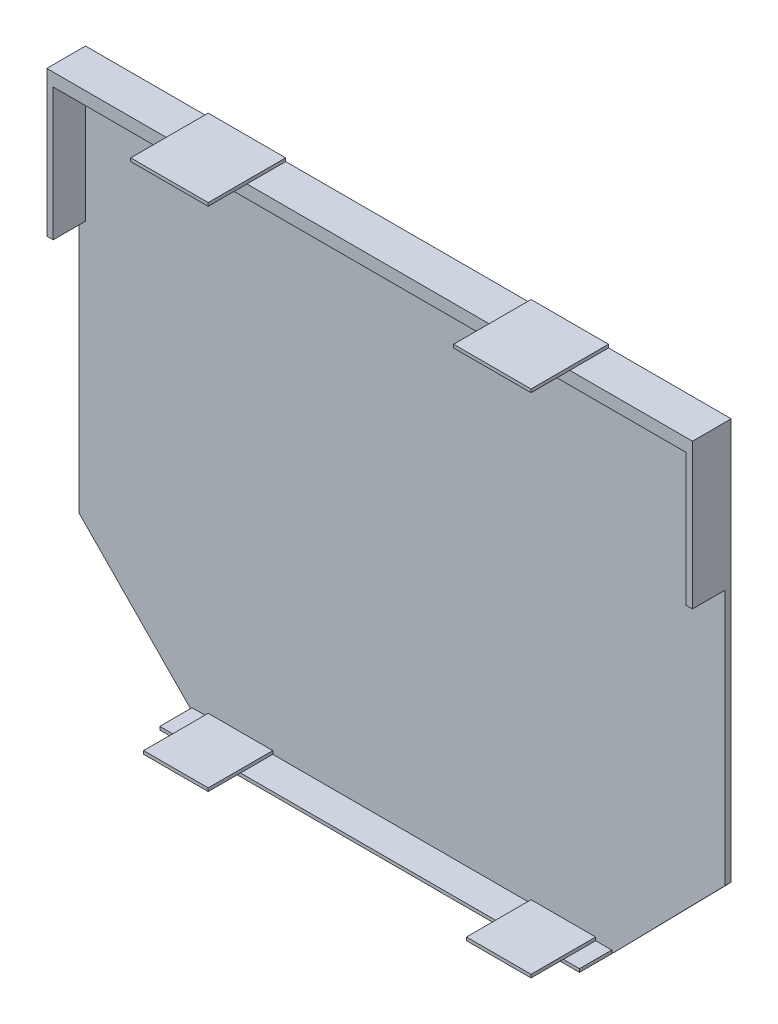
ISO-10303-21;
HEADER;
FILE_DESCRIPTION(('STEP AP214'),'2;1');
FILE_NAME('part.step','',(''),(''),'','','');
FILE_SCHEMA(('AUTOMOTIVE_DESIGN { 1 0 10303 214 1 1 1 1 }'));
ENDSEC;
DATA;
#1=APPLICATION_CONTEXT('core data for automotive mechanical design processes');
#2=APPLICATION_PROTOCOL_DEFINITION('international standard','automotive_design',2000,#1);
#3=PRODUCT_CONTEXT('',#1,'mechanical');
#4=PRODUCT('Part','Part','',(#3));
#5=PRODUCT_RELATED_PRODUCT_CATEGORY('part','',(#4));
#6=PRODUCT_DEFINITION_FORMATION('','',#4);
#7=PRODUCT_DEFINITION_CONTEXT('part definition',#1,'design');
#8=PRODUCT_DEFINITION('design','',#6,#7);
#9=PRODUCT_DEFINITION_SHAPE('','',#8);
#10=(LENGTH_UNIT() NAMED_UNIT(*) SI_UNIT(.MILLI.,.METRE.));
#11=(NAMED_UNIT(*) PLANE_ANGLE_UNIT() SI_UNIT($,.RADIAN.));
#12=(NAMED_UNIT(*) SI_UNIT($,.STERADIAN.) SOLID_ANGLE_UNIT());
#13=UNCERTAINTY_MEASURE_WITH_UNIT(LENGTH_MEASURE(1.E-05),#10,'distance_accuracy_value','');
#14=(GEOMETRIC_REPRESENTATION_CONTEXT(3) GLOBAL_UNCERTAINTY_ASSIGNED_CONTEXT((#13)) GLOBAL_UNIT_ASSIGNED_CONTEXT((#10,
#11,#12)) REPRESENTATION_CONTEXT('',''));
#15=CARTESIAN_POINT('',(0.,0.,0.));
#16=DIRECTION('',(0.,0.,1.));
#17=DIRECTION('',(1.,0.,0.));
#18=AXIS2_PLACEMENT_3D('',#15,#16,#17);
#19=CARTESIAN_POINT('',(0.,0.,-59.));
#20=DIRECTION('',(0.,0.,-1.));
#21=DIRECTION('',(-1.,0.,0.));
#22=AXIS2_PLACEMENT_3D('',#19,#20,#21);
#23=PLANE('',#22);
#24=DIRECTION('',(0.,-1.,0.));
#25=VECTOR('',#24,1.);
#26=CARTESIAN_POINT('',(140.,2.00000000000003,-59.));
#27=LINE('',#26,#25);
#28=CARTESIAN_POINT('',(140.,2.00000000000003,-59.));
#29=VERTEX_POINT('',#28);
#30=CARTESIAN_POINT('',(140.,1.,-59.));
#31=VERTEX_POINT('',#30);
#32=EDGE_CURVE('E55',#29,#31,#27,.T.);
#33=ORIENTED_EDGE('',*,*,#32,.F.);
#34=DIRECTION('',(-1.,0.,0.));
#35=VECTOR('',#34,1.);
#36=CARTESIAN_POINT('',(160.,2.00000000000003,-59.));
#37=LINE('',#36,#35);
#38=CARTESIAN_POINT('',(160.,2.00000000000003,-59.));
#39=VERTEX_POINT('',#38);
#40=EDGE_CURVE('E50',#39,#29,#37,.T.);
#41=ORIENTED_EDGE('',*,*,#40,.F.);
#42=DIRECTION('',(0.,-1.,0.));
#43=VECTOR('',#42,1.);
#44=CARTESIAN_POINT('',(160.,2.00000000000003,-59.));
#45=LINE('',#44,#43);
#46=CARTESIAN_POINT('',(160.,1.,-59.));
#47=VERTEX_POINT('',#46);
#48=EDGE_CURVE('E287',#39,#47,#45,.T.);
#49=ORIENTED_EDGE('',*,*,#48,.T.);
#50=DIRECTION('',(1.,0.,0.));
#51=VECTOR('',#50,1.);
#52=CARTESIAN_POINT('',(35.,1.,-59.));
#53=LINE('',#52,#51);
#54=CARTESIAN_POINT('',(165.,1.,-59.));
#55=VERTEX_POINT('',#54);
#56=EDGE_CURVE('E420',#47,#55,#53,.T.);
#57=ORIENTED_EDGE('',*,*,#56,.T.);
#58=DIRECTION('',(0.,1.,0.));
#59=VECTOR('',#58,1.);
#60=CARTESIAN_POINT('',(165.,0.,-59.));
#61=LINE('',#60,#59);
#62=CARTESIAN_POINT('',(165.,0.,-59.));
#63=VERTEX_POINT('',#62);
#64=EDGE_CURVE('E424',#63,#55,#61,.T.);
#65=ORIENTED_EDGE('',*,*,#64,.F.);
#66=DIRECTION('',(0.7,0.714142842854285,0.));
#67=VECTOR('',#66,1.);
#68=CARTESIAN_POINT('',(84.15,-82.4834983496699,-59.));
#69=LINE('',#68,#67);
#70=CARTESIAN_POINT('',(200.,35.7071421427142,-59.));
#71=VERTEX_POINT('',#70);
#72=EDGE_CURVE('E451',#63,#71,#69,.T.);
#73=ORIENTED_EDGE('',*,*,#72,.T.);
#74=DIRECTION('',(0.,-1.,0.));
#75=VECTOR('',#74,1.);
#76=CARTESIAN_POINT('',(200.,0.,-59.));
#77=LINE('',#76,#75);
#78=CARTESIAN_POINT('',(200.,115.,-59.));
#79=VERTEX_POINT('',#78);
#80=EDGE_CURVE('E455',#79,#71,#77,.T.);
#81=ORIENTED_EDGE('',*,*,#80,.F.);
#82=DIRECTION('',(1.,0.,0.));
#83=VECTOR('',#82,1.);
#84=CARTESIAN_POINT('',(1.5959455978987E-12,115.000000000003,-59.));
#85=LINE('',#84,#83);
#86=CARTESIAN_POINT('',(198.,115.,-59.));
#87=VERTEX_POINT('',#86);
#88=EDGE_CURVE('E413',#87,#79,#85,.T.);
#89=ORIENTED_EDGE('',*,*,#88,.F.);
#90=DIRECTION('',(0.,-1.,0.));
#91=VECTOR('',#90,1.);
#92=CARTESIAN_POINT('',(198.,0.,-59.));
#93=LINE('',#92,#91);
#94=CARTESIAN_POINT('',(198.,156.,-59.));
#95=VERTEX_POINT('',#94);
#96=EDGE_CURVE('E410',#95,#87,#93,.T.);
#97=ORIENTED_EDGE('',*,*,#96,.F.);
#98=DIRECTION('',(1.,0.,0.));
#99=VECTOR('',#98,1.);
#100=CARTESIAN_POINT('',(0.,156.,-59.));
#101=LINE('',#100,#99);
#102=CARTESIAN_POINT('',(2.,156.,-59.));
#103=VERTEX_POINT('',#102);
#104=EDGE_CURVE('E407',#103,#95,#101,.T.);
#105=ORIENTED_EDGE('',*,*,#104,.F.);
#106=DIRECTION('',(0.,-1.,0.));
#107=VECTOR('',#106,1.);
#108=CARTESIAN_POINT('',(2.00000000000002,0.,-59.));
#109=LINE('',#108,#107);
#110=CARTESIAN_POINT('',(2.,115.,-59.));
#111=VERTEX_POINT('',#110);
#112=EDGE_CURVE('E392',#103,#111,#109,.T.);
#113=ORIENTED_EDGE('',*,*,#112,.T.);
#114=DIRECTION('',(-1.,0.,0.));
#115=VECTOR('',#114,1.);
#116=CARTESIAN_POINT('',(0.,115.,-59.));
#117=LINE('',#116,#115);
#118=CARTESIAN_POINT('',(0.,115.,-59.));
#119=VERTEX_POINT('',#118);
#120=EDGE_CURVE('E396',#111,#119,#117,.T.);
#121=ORIENTED_EDGE('',*,*,#120,.T.);
#122=DIRECTION('',(0.,-1.,0.));
#123=VECTOR('',#122,1.);
#124=CARTESIAN_POINT('',(0.,0.,-59.));
#125=LINE('',#124,#123);
#126=CARTESIAN_POINT('',(0.,35.7071421427142,-59.));
#127=VERTEX_POINT('',#126);
#128=EDGE_CURVE('E457',#119,#127,#125,.T.);
#129=ORIENTED_EDGE('',*,*,#128,.T.);
#130=DIRECTION('',(-0.7,0.714142842854285,0.));
#131=VECTOR('',#130,1.);
#132=CARTESIAN_POINT('',(17.85,17.49649964993,-59.));
#133=LINE('',#132,#131);
#134=CARTESIAN_POINT('',(35.,0.,-59.));
#135=VERTEX_POINT('',#134);
#136=EDGE_CURVE('E448',#135,#127,#133,.T.);
#137=ORIENTED_EDGE('',*,*,#136,.F.);
#138=DIRECTION('',(0.,1.,0.));
#139=VECTOR('',#138,1.);
#140=CARTESIAN_POINT('',(35.,0.,-59.));
#141=LINE('',#140,#139);
#142=CARTESIAN_POINT('',(35.,1.,-59.));
#143=VERTEX_POINT('',#142);
#144=EDGE_CURVE('E404',#135,#143,#141,.T.);
#145=ORIENTED_EDGE('',*,*,#144,.T.);
#146=CARTESIAN_POINT('',(40.,1.00000000000001,-59.));
#147=VERTEX_POINT('',#146);
#148=EDGE_CURVE('E421',#143,#147,#53,.T.);
#149=ORIENTED_EDGE('',*,*,#148,.T.);
#150=DIRECTION('',(0.,-1.,0.));
#151=VECTOR('',#150,1.);
#152=CARTESIAN_POINT('',(40.,2.00000000000001,-59.));
#153=LINE('',#152,#151);
#154=CARTESIAN_POINT('',(40.,2.00000000000001,-59.));
#155=VERTEX_POINT('',#154);
#156=EDGE_CURVE('E300',#155,#147,#153,.T.);
#157=ORIENTED_EDGE('',*,*,#156,.F.);
#158=DIRECTION('',(-1.,0.,0.));
#159=VECTOR('',#158,1.);
#160=CARTESIAN_POINT('',(60.,2.00000000000001,-59.));
#161=LINE('',#160,#159);
#162=CARTESIAN_POINT('',(60.,2.00000000000001,-59.));
#163=VERTEX_POINT('',#162);
#164=EDGE_CURVE('E299',#163,#155,#161,.T.);
#165=ORIENTED_EDGE('',*,*,#164,.F.);
#166=DIRECTION('',(0.,-1.,0.));
#167=VECTOR('',#166,1.);
#168=CARTESIAN_POINT('',(60.,2.00000000000001,-59.));
#169=LINE('',#168,#167);
#170=CARTESIAN_POINT('',(60.,1.00000000000001,-59.));
#171=VERTEX_POINT('',#170);
#172=EDGE_CURVE('E307',#163,#171,#169,.T.);
#173=ORIENTED_EDGE('',*,*,#172,.T.);
#174=EDGE_CURVE('E425',#171,#31,#53,.T.);
#175=ORIENTED_EDGE('',*,*,#174,.T.);
#176=EDGE_LOOP('',(#33,#41,#49,#57,#65,#73,#81,#89,#97,#105,#113,#121,#129,#137,#145,#149,#157,
#165,#173,#175));
#177=FACE_BOUND('',#176,.T.);
#178=ADVANCED_FACE('F35',(#177),#23,.F.);
#179=CARTESIAN_POINT('',(1.00000000000002,1.,-49.));
#180=DIRECTION('',(0.,1.,0.));
#181=DIRECTION('',(-1.,0.,0.));
#182=AXIS2_PLACEMENT_3D('',#179,#180,#181);
#183=PLANE('',#182);
#184=DIRECTION('',(1.,0.,0.));
#185=VECTOR('',#184,1.);
#186=CARTESIAN_POINT('',(1.00000000000002,1.,-49.));
#187=LINE('',#186,#185);
#188=CARTESIAN_POINT('',(60.0000000000001,1.00000000000001,-49.));
#189=VERTEX_POINT('',#188);
#190=CARTESIAN_POINT('',(140.,1.00000000000003,-49.));
#191=VERTEX_POINT('',#190);
#192=EDGE_CURVE('E558',#189,#191,#187,.T.);
#193=ORIENTED_EDGE('',*,*,#192,.T.);
#194=DIRECTION('',(0.,0.,1.));
#195=VECTOR('',#194,1.);
#196=CARTESIAN_POINT('',(140.,1.00000000000003,-39.));
#197=LINE('',#196,#195);
#198=EDGE_CURVE('E542',#31,#191,#197,.T.);
#199=ORIENTED_EDGE('',*,*,#198,.F.);
#200=ORIENTED_EDGE('',*,*,#174,.F.);
#201=DIRECTION('',(0.,0.,1.));
#202=VECTOR('',#201,1.);
#203=CARTESIAN_POINT('',(60.0000000000001,1.00000000000001,-49.));
#204=LINE('',#203,#202);
#205=EDGE_CURVE('E11',#171,#189,#204,.T.);
#206=ORIENTED_EDGE('',*,*,#205,.T.);
#207=EDGE_LOOP('',(#193,#199,#200,#206));
#208=FACE_BOUND('',#207,.T.);
#209=ADVANCED_FACE('F565',(#208),#183,.T.);
#210=ORIENTED_EDGE('',*,*,#56,.F.);
#211=DIRECTION('',(0.,0.,-1.));
#212=VECTOR('',#211,1.);
#213=CARTESIAN_POINT('',(160.,1.00000000000003,-39.));
#214=LINE('',#213,#212);
#215=CARTESIAN_POINT('',(160.,1.00000000000003,-49.));
#216=VERTEX_POINT('',#215);
#217=EDGE_CURVE('E520',#216,#47,#214,.T.);
#218=ORIENTED_EDGE('',*,*,#217,.F.);
#219=CARTESIAN_POINT('',(165.,1.,-49.));
#220=VERTEX_POINT('',#219);
#221=EDGE_CURVE('E480',#216,#220,#187,.T.);
#222=ORIENTED_EDGE('',*,*,#221,.T.);
#223=DIRECTION('',(0.,0.,1.));
#224=VECTOR('',#223,1.);
#225=CARTESIAN_POINT('',(165.,1.,4.));
#226=LINE('',#225,#224);
#227=EDGE_CURVE('E383',#55,#220,#226,.T.);
#228=ORIENTED_EDGE('',*,*,#227,.F.);
#229=EDGE_LOOP('',(#210,#218,#222,#228));
#230=FACE_BOUND('',#229,.T.);
#231=ADVANCED_FACE('F517',(#230),#183,.T.);
#232=CARTESIAN_POINT('',(35.,1.,-49.));
#233=VERTEX_POINT('',#232);
#234=CARTESIAN_POINT('',(40.,1.00000000000001,-49.));
#235=VERTEX_POINT('',#234);
#236=EDGE_CURVE('E475',#233,#235,#187,.T.);
#237=ORIENTED_EDGE('',*,*,#236,.T.);
#238=DIRECTION('',(0.,0.,1.));
#239=VECTOR('',#238,1.);
#240=CARTESIAN_POINT('',(40.,1.00000000000001,-39.));
#241=LINE('',#240,#239);
#242=EDGE_CURVE('E285',#147,#235,#241,.T.);
#243=ORIENTED_EDGE('',*,*,#242,.F.);
#244=ORIENTED_EDGE('',*,*,#148,.F.);
#245=DIRECTION('',(0.,0.,-1.));
#246=VECTOR('',#245,1.);
#247=CARTESIAN_POINT('',(35.,1.,4.));
#248=LINE('',#247,#246);
#249=EDGE_CURVE('E508',#233,#143,#248,.T.);
#250=ORIENTED_EDGE('',*,*,#249,.F.);
#251=EDGE_LOOP('',(#237,#243,#244,#250));
#252=FACE_BOUND('',#251,.T.);
#253=ADVANCED_FACE('F580',(#252),#183,.T.);
#254=CARTESIAN_POINT('',(0.,160.,4.));
#255=DIRECTION('',(0.,1.,0.));
#256=DIRECTION('',(0.,0.,1.));
#257=AXIS2_PLACEMENT_3D('',#254,#255,#256);
#258=PLANE('',#257);
#259=DIRECTION('',(1.,0.,0.));
#260=VECTOR('',#259,1.);
#261=CARTESIAN_POINT('',(0.,160.,-61.));
#262=LINE('',#261,#260);
#263=CARTESIAN_POINT('',(62.,160.,-61.));
#264=VERTEX_POINT('',#263);
#265=CARTESIAN_POINT('',(138.,160.,-61.));
#266=VERTEX_POINT('',#265);
#267=EDGE_CURVE('E472',#264,#266,#262,.T.);
#268=ORIENTED_EDGE('',*,*,#267,.F.);
#269=DIRECTION('',(0.,0.,-1.));
#270=VECTOR('',#269,1.);
#271=CARTESIAN_POINT('',(62.,160.,-61.));
#272=LINE('',#271,#270);
#273=CARTESIAN_POINT('',(62.,160.,-49.));
#274=VERTEX_POINT('',#273);
#275=EDGE_CURVE('E316',#274,#264,#272,.T.);
#276=ORIENTED_EDGE('',*,*,#275,.F.);
#277=DIRECTION('',(-1.,0.,0.));
#278=VECTOR('',#277,1.);
#279=CARTESIAN_POINT('',(84.,160.,-49.));
#280=LINE('',#279,#278);
#281=CARTESIAN_POINT('',(138.,160.,-49.));
#282=VERTEX_POINT('',#281);
#283=EDGE_CURVE('E1186',#282,#274,#280,.T.);
#284=ORIENTED_EDGE('',*,*,#283,.F.);
#285=DIRECTION('',(0.,0.,1.));
#286=VECTOR('',#285,1.);
#287=CARTESIAN_POINT('',(138.,160.,-61.0000000000001));
#288=LINE('',#287,#286);
#289=EDGE_CURVE('E360',#266,#282,#288,.T.);
#290=ORIENTED_EDGE('',*,*,#289,.F.);
#291=EDGE_LOOP('',(#268,#276,#284,#290));
#292=FACE_BOUND('',#291,.T.);
#293=ADVANCED_FACE('F620',(#292),#258,.T.);
#294=CARTESIAN_POINT('',(38.,160.,-49.));
#295=VERTEX_POINT('',#294);
#296=CARTESIAN_POINT('',(0.,160.,-49.));
#297=VERTEX_POINT('',#296);
#298=EDGE_CURVE('E430',#295,#297,#280,.T.);
#299=ORIENTED_EDGE('',*,*,#298,.F.);
#300=DIRECTION('',(0.,0.,1.));
#301=VECTOR('',#300,1.);
#302=CARTESIAN_POINT('',(38.,160.,-61.));
#303=LINE('',#302,#301);
#304=CARTESIAN_POINT('',(38.,160.,-61.));
#305=VERTEX_POINT('',#304);
#306=EDGE_CURVE('E332',#305,#295,#303,.T.);
#307=ORIENTED_EDGE('',*,*,#306,.F.);
#308=CARTESIAN_POINT('',(0.,160.,-61.));
#309=VERTEX_POINT('',#308);
#310=EDGE_CURVE('E469',#309,#305,#262,.T.);
#311=ORIENTED_EDGE('',*,*,#310,.F.);
#312=DIRECTION('',(0.,0.,1.));
#313=VECTOR('',#312,1.);
#314=CARTESIAN_POINT('',(0.,160.,-59.));
#315=LINE('',#314,#313);
#316=EDGE_CURVE('E379',#309,#297,#315,.T.);
#317=ORIENTED_EDGE('',*,*,#316,.T.);
#318=EDGE_LOOP('',(#299,#307,#311,#317));
#319=FACE_BOUND('',#318,.T.);
#320=ADVANCED_FACE('F614',(#319),#258,.T.);
#321=CARTESIAN_POINT('',(0.,-0.0100000000000378,-49.));
#322=DIRECTION('',(0.,0.,1.));
#323=DIRECTION('',(1.,0.,0.));
#324=AXIS2_PLACEMENT_3D('',#321,#322,#323);
#325=PLANE('',#324);
#326=DIRECTION('',(0.,-1.,0.));
#327=VECTOR('',#326,1.);
#328=CARTESIAN_POINT('',(35.,0.,-49.));
#329=LINE('',#328,#327);
#330=CARTESIAN_POINT('',(35.,0.,-49.));
#331=VERTEX_POINT('',#330);
#332=EDGE_CURVE('E487',#233,#331,#329,.T.);
#333=ORIENTED_EDGE('',*,*,#332,.T.);
#334=DIRECTION('',(1.,0.,0.));
#335=VECTOR('',#334,1.);
#336=CARTESIAN_POINT('',(0.,0.,-49.));
#337=LINE('',#336,#335);
#338=CARTESIAN_POINT('',(165.,0.,-49.));
#339=VERTEX_POINT('',#338);
#340=EDGE_CURVE('E378',#331,#339,#337,.T.);
#341=ORIENTED_EDGE('',*,*,#340,.T.);
#342=DIRECTION('',(0.,-1.,0.));
#343=VECTOR('',#342,1.);
#344=CARTESIAN_POINT('',(165.,0.,-49.));
#345=LINE('',#344,#343);
#346=EDGE_CURVE('E484',#220,#339,#345,.T.);
#347=ORIENTED_EDGE('',*,*,#346,.F.);
#348=ORIENTED_EDGE('',*,*,#221,.F.);
#349=EDGE_CURVE('E523',#191,#216,#187,.T.);
#350=ORIENTED_EDGE('',*,*,#349,.F.);
#351=ORIENTED_EDGE('',*,*,#192,.F.);
#352=EDGE_CURVE('E479',#235,#189,#187,.T.);
#353=ORIENTED_EDGE('',*,*,#352,.F.);
#354=ORIENTED_EDGE('',*,*,#236,.F.);
#355=EDGE_LOOP('',(#333,#341,#347,#348,#350,#351,#353,#354));
#356=FACE_BOUND('',#355,.T.);
#357=ADVANCED_FACE('F524',(#356),#325,.T.);
#358=DIRECTION('',(0.,-1.,0.));
#359=VECTOR('',#358,1.);
#360=CARTESIAN_POINT('',(198.,0.,-49.));
#361=LINE('',#360,#359);
#362=CARTESIAN_POINT('',(198.,156.,-49.));
#363=VERTEX_POINT('',#362);
#364=CARTESIAN_POINT('',(198.,115.,-49.));
#365=VERTEX_POINT('',#364);
#366=EDGE_CURVE('E395',#363,#365,#361,.T.);
#367=ORIENTED_EDGE('',*,*,#366,.T.);
#368=DIRECTION('',(-1.,0.,0.));
#369=VECTOR('',#368,1.);
#370=CARTESIAN_POINT('',(0.,115.,-49.));
#371=LINE('',#370,#369);
#372=CARTESIAN_POINT('',(200.,115.,-49.));
#373=VERTEX_POINT('',#372);
#374=EDGE_CURVE('E481',#373,#365,#371,.T.);
#375=ORIENTED_EDGE('',*,*,#374,.F.);
#376=DIRECTION('',(0.,1.,0.));
#377=VECTOR('',#376,1.);
#378=CARTESIAN_POINT('',(200.,0.,-49.));
#379=LINE('',#378,#377);
#380=CARTESIAN_POINT('',(200.,160.,-49.));
#381=VERTEX_POINT('',#380);
#382=EDGE_CURVE('E398',#373,#381,#379,.T.);
#383=ORIENTED_EDGE('',*,*,#382,.T.);
#384=CARTESIAN_POINT('',(162.,160.,-49.));
#385=VERTEX_POINT('',#384);
#386=EDGE_CURVE('E431',#381,#385,#280,.T.);
#387=ORIENTED_EDGE('',*,*,#386,.T.);
#388=EDGE_CURVE('E435',#385,#282,#280,.T.);
#389=ORIENTED_EDGE('',*,*,#388,.T.);
#390=ORIENTED_EDGE('',*,*,#283,.T.);
#391=DIRECTION('',(-1.,0.,0.));
#392=VECTOR('',#391,1.);
#393=CARTESIAN_POINT('',(0.,160.,-49.));
#394=LINE('',#393,#392);
#395=EDGE_CURVE('E345',#274,#295,#394,.T.);
#396=ORIENTED_EDGE('',*,*,#395,.T.);
#397=ORIENTED_EDGE('',*,*,#298,.T.);
#398=DIRECTION('',(0.,1.,0.));
#399=VECTOR('',#398,1.);
#400=CARTESIAN_POINT('',(0.,0.,-49.));
#401=LINE('',#400,#399);
#402=CARTESIAN_POINT('',(0.,115.,-49.));
#403=VERTEX_POINT('',#402);
#404=EDGE_CURVE('E401',#403,#297,#401,.T.);
#405=ORIENTED_EDGE('',*,*,#404,.F.);
#406=DIRECTION('',(1.,0.,0.));
#407=VECTOR('',#406,1.);
#408=CARTESIAN_POINT('',(0.,115.,-49.));
#409=LINE('',#408,#407);
#410=CARTESIAN_POINT('',(2.,115.,-49.));
#411=VERTEX_POINT('',#410);
#412=EDGE_CURVE('E490',#403,#411,#409,.T.);
#413=ORIENTED_EDGE('',*,*,#412,.T.);
#414=DIRECTION('',(0.,-1.,0.));
#415=VECTOR('',#414,1.);
#416=CARTESIAN_POINT('',(2.00000000000002,0.,-49.));
#417=LINE('',#416,#415);
#418=CARTESIAN_POINT('',(2.,156.,-49.));
#419=VERTEX_POINT('',#418);
#420=EDGE_CURVE('E393',#419,#411,#417,.T.);
#421=ORIENTED_EDGE('',*,*,#420,.F.);
#422=DIRECTION('',(1.,0.,0.));
#423=VECTOR('',#422,1.);
#424=CARTESIAN_POINT('',(2.,156.,-49.));
#425=LINE('',#424,#423);
#426=EDGE_CURVE('E428',#419,#363,#425,.T.);
#427=ORIENTED_EDGE('',*,*,#426,.T.);
#428=EDGE_LOOP('',(#367,#375,#383,#387,#389,#390,#396,#397,#405,#413,#421,#427));
#429=FACE_BOUND('',#428,.T.);
#430=ADVANCED_FACE('F613',(#429),#325,.T.);
#431=CARTESIAN_POINT('',(84.15,-82.4834983496699,-61.));
#432=DIRECTION('',(0.714142842854285,-0.7,0.));
#433=DIRECTION('',(0.7,0.714142842854285,0.));
#434=AXIS2_PLACEMENT_3D('',#431,#432,#433);
#435=PLANE('',#434);
#436=ORIENTED_EDGE('',*,*,#72,.F.);
#437=DIRECTION('',(0.,0.,1.));
#438=VECTOR('',#437,1.);
#439=CARTESIAN_POINT('',(165.,0.,-61.));
#440=LINE('',#439,#438);
#441=CARTESIAN_POINT('',(165.,0.,-61.));
#442=VERTEX_POINT('',#441);
#443=EDGE_CURVE('E438',#442,#63,#440,.T.);
#444=ORIENTED_EDGE('',*,*,#443,.F.);
#445=DIRECTION('',(0.7,0.714142842854285,0.));
#446=VECTOR('',#445,1.);
#447=CARTESIAN_POINT('',(84.15,-82.4834983496699,-61.));
#448=LINE('',#447,#446);
#449=CARTESIAN_POINT('',(200.,35.7071421427142,-61.));
#450=VERTEX_POINT('',#449);
#451=EDGE_CURVE('E463',#442,#450,#448,.T.);
#452=ORIENTED_EDGE('',*,*,#451,.T.);
#453=DIRECTION('',(0.,0.,1.));
#454=VECTOR('',#453,1.);
#455=CARTESIAN_POINT('',(200.,35.7071421427142,-61.));
#456=LINE('',#455,#454);
#457=EDGE_CURVE('E434',#450,#71,#456,.T.);
#458=ORIENTED_EDGE('',*,*,#457,.T.);
#459=EDGE_LOOP('',(#436,#444,#452,#458));
#460=FACE_BOUND('',#459,.T.);
#461=ADVANCED_FACE('F533',(#460),#435,.T.);
#462=CARTESIAN_POINT('',(0.,115.,4.));
#463=DIRECTION('',(0.,-1.,0.));
#464=DIRECTION('',(0.,0.,-1.));
#465=AXIS2_PLACEMENT_3D('',#462,#463,#464);
#466=PLANE('',#465);
#467=DIRECTION('',(0.,0.,-1.));
#468=VECTOR('',#467,1.);
#469=CARTESIAN_POINT('',(200.,115.,4.));
#470=LINE('',#469,#468);
#471=EDGE_CURVE('E478',#373,#79,#470,.T.);
#472=ORIENTED_EDGE('',*,*,#471,.F.);
#473=ORIENTED_EDGE('',*,*,#374,.T.);
#474=DIRECTION('',(0.,0.,1.));
#475=VECTOR('',#474,1.);
#476=CARTESIAN_POINT('',(198.,115.,-49.));
#477=LINE('',#476,#475);
#478=EDGE_CURVE('E498',#87,#365,#477,.T.);
#479=ORIENTED_EDGE('',*,*,#478,.F.);
#480=ORIENTED_EDGE('',*,*,#88,.T.);
#481=EDGE_LOOP('',(#472,#473,#479,#480));
#482=FACE_BOUND('',#481,.T.);
#483=ADVANCED_FACE('F37',(#482),#466,.T.);
#484=CARTESIAN_POINT('',(198.,156.,-49.));
#485=DIRECTION('',(-1.,0.,0.));
#486=DIRECTION('',(0.,0.,1.));
#487=AXIS2_PLACEMENT_3D('',#484,#485,#486);
#488=PLANE('',#487);
#489=ORIENTED_EDGE('',*,*,#478,.T.);
#490=ORIENTED_EDGE('',*,*,#366,.F.);
#491=DIRECTION('',(0.,0.,1.));
#492=VECTOR('',#491,1.);
#493=CARTESIAN_POINT('',(198.,156.,-59.));
#494=LINE('',#493,#492);
#495=EDGE_CURVE('E386',#95,#363,#494,.T.);
#496=ORIENTED_EDGE('',*,*,#495,.F.);
#497=ORIENTED_EDGE('',*,*,#96,.T.);
#498=EDGE_LOOP('',(#489,#490,#496,#497));
#499=FACE_BOUND('',#498,.T.);
#500=ADVANCED_FACE('F636',(#499),#488,.T.);
#501=CARTESIAN_POINT('',(2.,156.,-49.));
#502=DIRECTION('',(1.,0.,0.));
#503=DIRECTION('',(0.,1.,0.));
#504=AXIS2_PLACEMENT_3D('',#501,#502,#503);
#505=PLANE('',#504);
#506=ORIENTED_EDGE('',*,*,#420,.T.);
#507=DIRECTION('',(0.,0.,1.));
#508=VECTOR('',#507,1.);
#509=CARTESIAN_POINT('',(2.,115.,-49.));
#510=LINE('',#509,#508);
#511=EDGE_CURVE('E501',#111,#411,#510,.T.);
#512=ORIENTED_EDGE('',*,*,#511,.F.);
#513=ORIENTED_EDGE('',*,*,#112,.F.);
#514=DIRECTION('',(0.,0.,1.));
#515=VECTOR('',#514,1.);
#516=CARTESIAN_POINT('',(2.,156.,-59.));
#517=LINE('',#516,#515);
#518=EDGE_CURVE('E389',#103,#419,#517,.T.);
#519=ORIENTED_EDGE('',*,*,#518,.T.);
#520=EDGE_LOOP('',(#506,#512,#513,#519));
#521=FACE_BOUND('',#520,.T.);
#522=ADVANCED_FACE('F837',(#521),#505,.T.);
#523=CARTESIAN_POINT('',(2.,156.,-49.));
#524=DIRECTION('',(0.,-1.,0.));
#525=DIRECTION('',(0.,0.,-1.));
#526=AXIS2_PLACEMENT_3D('',#523,#524,#525);
#527=PLANE('',#526);
#528=ORIENTED_EDGE('',*,*,#495,.T.);
#529=ORIENTED_EDGE('',*,*,#426,.F.);
#530=ORIENTED_EDGE('',*,*,#518,.F.);
#531=ORIENTED_EDGE('',*,*,#104,.T.);
#532=EDGE_LOOP('',(#528,#529,#530,#531));
#533=FACE_BOUND('',#532,.T.);
#534=ADVANCED_FACE('F855',(#533),#527,.T.);
#535=CARTESIAN_POINT('',(17.85,17.49649964993,-61.));
#536=DIRECTION('',(0.714142842854285,0.7,0.));
#537=DIRECTION('',(-0.7,0.714142842854285,0.));
#538=AXIS2_PLACEMENT_3D('',#535,#536,#537);
#539=PLANE('',#538);
#540=ORIENTED_EDGE('',*,*,#136,.T.);
#541=DIRECTION('',(0.,0.,1.));
#542=VECTOR('',#541,1.);
#543=CARTESIAN_POINT('',(0.,35.7071421427142,-61.));
#544=LINE('',#543,#542);
#545=CARTESIAN_POINT('',(0.,35.7071421427142,-61.));
#546=VERTEX_POINT('',#545);
#547=EDGE_CURVE('E444',#546,#127,#544,.T.);
#548=ORIENTED_EDGE('',*,*,#547,.F.);
#549=DIRECTION('',(-0.7,0.714142842854285,0.));
#550=VECTOR('',#549,1.);
#551=CARTESIAN_POINT('',(17.85,17.49649964993,-61.));
#552=LINE('',#551,#550);
#553=CARTESIAN_POINT('',(35.,0.,-61.));
#554=VERTEX_POINT('',#553);
#555=EDGE_CURVE('E447',#554,#546,#552,.T.);
#556=ORIENTED_EDGE('',*,*,#555,.F.);
#557=DIRECTION('',(0.,0.,1.));
#558=VECTOR('',#557,1.);
#559=CARTESIAN_POINT('',(35.,0.,-61.));
#560=LINE('',#559,#558);
#561=EDGE_CURVE('E441',#554,#135,#560,.T.);
#562=ORIENTED_EDGE('',*,*,#561,.T.);
#563=EDGE_LOOP('',(#540,#548,#556,#562));
#564=FACE_BOUND('',#563,.T.);
#565=ADVANCED_FACE('F604',(#564),#539,.F.);
#566=CARTESIAN_POINT('',(0.,115.,4.));
#567=DIRECTION('',(0.,1.,0.));
#568=DIRECTION('',(0.,0.,1.));
#569=AXIS2_PLACEMENT_3D('',#566,#567,#568);
#570=PLANE('',#569);
#571=ORIENTED_EDGE('',*,*,#412,.F.);
#572=DIRECTION('',(0.,0.,-1.));
#573=VECTOR('',#572,1.);
#574=CARTESIAN_POINT('',(0.,115.,4.));
#575=LINE('',#574,#573);
#576=EDGE_CURVE('E496',#403,#119,#575,.T.);
#577=ORIENTED_EDGE('',*,*,#576,.T.);
#578=ORIENTED_EDGE('',*,*,#120,.F.);
#579=ORIENTED_EDGE('',*,*,#511,.T.);
#580=EDGE_LOOP('',(#571,#577,#578,#579));
#581=FACE_BOUND('',#580,.T.);
#582=ADVANCED_FACE('F888',(#581),#570,.F.);
#583=CARTESIAN_POINT('',(0.,0.,4.));
#584=DIRECTION('',(-1.,0.,0.));
#585=DIRECTION('',(0.,0.,1.));
#586=AXIS2_PLACEMENT_3D('',#583,#584,#585);
#587=PLANE('',#586);
#588=ORIENTED_EDGE('',*,*,#576,.F.);
#589=ORIENTED_EDGE('',*,*,#404,.T.);
#590=ORIENTED_EDGE('',*,*,#316,.F.);
#591=DIRECTION('',(0.,-1.,0.));
#592=VECTOR('',#591,1.);
#593=CARTESIAN_POINT('',(0.,0.,-61.));
#594=LINE('',#593,#592);
#595=EDGE_CURVE('E452',#309,#546,#594,.T.);
#596=ORIENTED_EDGE('',*,*,#595,.T.);
#597=ORIENTED_EDGE('',*,*,#547,.T.);
#598=ORIENTED_EDGE('',*,*,#128,.F.);
#599=EDGE_LOOP('',(#588,#589,#590,#596,#597,#598));
#600=FACE_BOUND('',#599,.T.);
#601=ADVANCED_FACE('F610',(#600),#587,.T.);
#602=CARTESIAN_POINT('',(0.,0.,-61.));
#603=DIRECTION('',(0.,0.,-1.));
#604=DIRECTION('',(-1.,0.,0.));
#605=AXIS2_PLACEMENT_3D('',#602,#603,#604);
#606=PLANE('',#605);
#607=ORIENTED_EDGE('',*,*,#595,.F.);
#608=ORIENTED_EDGE('',*,*,#310,.T.);
#609=DIRECTION('',(0.,-1.,0.));
#610=VECTOR('',#609,1.);
#611=CARTESIAN_POINT('',(38.,161.,-61.));
#612=LINE('',#611,#610);
#613=CARTESIAN_POINT('',(38.,161.,-61.));
#614=VERTEX_POINT('',#613);
#615=EDGE_CURVE('E341',#614,#305,#612,.T.);
#616=ORIENTED_EDGE('',*,*,#615,.F.);
#617=DIRECTION('',(-1.,0.,0.));
#618=VECTOR('',#617,1.);
#619=CARTESIAN_POINT('',(38.,161.,-61.));
#620=LINE('',#619,#618);
#621=CARTESIAN_POINT('',(62.,161.,-61.));
#622=VERTEX_POINT('',#621);
#623=EDGE_CURVE('E320',#622,#614,#620,.T.);
#624=ORIENTED_EDGE('',*,*,#623,.F.);
#625=DIRECTION('',(0.,-1.,0.));
#626=VECTOR('',#625,1.);
#627=CARTESIAN_POINT('',(62.,161.,-61.));
#628=LINE('',#627,#626);
#629=EDGE_CURVE('E343',#622,#264,#628,.T.);
#630=ORIENTED_EDGE('',*,*,#629,.T.);
#631=ORIENTED_EDGE('',*,*,#267,.T.);
#632=DIRECTION('',(0.,-1.,0.));
#633=VECTOR('',#632,1.);
#634=CARTESIAN_POINT('',(138.,161.,-61.0000000000001));
#635=LINE('',#634,#633);
#636=CARTESIAN_POINT('',(138.,161.,-61.0000000000001));
#637=VERTEX_POINT('',#636);
#638=EDGE_CURVE('E359',#637,#266,#635,.T.);
#639=ORIENTED_EDGE('',*,*,#638,.F.);
#640=DIRECTION('',(-1.,0.,0.));
#641=VECTOR('',#640,1.);
#642=CARTESIAN_POINT('',(162.,161.,-61.));
#643=LINE('',#642,#641);
#644=CARTESIAN_POINT('',(162.,161.,-61.));
#645=VERTEX_POINT('',#644);
#646=EDGE_CURVE('E357',#645,#637,#643,.T.);
#647=ORIENTED_EDGE('',*,*,#646,.F.);
#648=DIRECTION('',(0.,-1.,0.));
#649=VECTOR('',#648,1.);
#650=CARTESIAN_POINT('',(162.,161.,-61.));
#651=LINE('',#650,#649);
#652=CARTESIAN_POINT('',(162.,160.,-61.));
#653=VERTEX_POINT('',#652);
#654=EDGE_CURVE('E369',#645,#653,#651,.T.);
#655=ORIENTED_EDGE('',*,*,#654,.T.);
#656=CARTESIAN_POINT('',(200.,160.,-61.));
#657=VERTEX_POINT('',#656);
#658=EDGE_CURVE('E468',#653,#657,#262,.T.);
#659=ORIENTED_EDGE('',*,*,#658,.T.);
#660=DIRECTION('',(0.,-1.,0.));
#661=VECTOR('',#660,1.);
#662=CARTESIAN_POINT('',(200.,0.,-61.));
#663=LINE('',#662,#661);
#664=EDGE_CURVE('E466',#657,#450,#663,.T.);
#665=ORIENTED_EDGE('',*,*,#664,.T.);
#666=ORIENTED_EDGE('',*,*,#451,.F.);
#667=DIRECTION('',(1.,0.,0.));
#668=VECTOR('',#667,1.);
#669=CARTESIAN_POINT('',(0.,0.,-61.));
#670=LINE('',#669,#668);
#671=EDGE_CURVE('E460',#554,#442,#670,.T.);
#672=ORIENTED_EDGE('',*,*,#671,.F.);
#673=ORIENTED_EDGE('',*,*,#555,.T.);
#674=EDGE_LOOP('',(#607,#608,#616,#624,#630,#631,#639,#647,#655,#659,#665,#666,#672,#673));
#675=FACE_BOUND('',#674,.T.);
#676=ADVANCED_FACE('F606',(#675),#606,.T.);
#677=CARTESIAN_POINT('',(200.,0.,4.));
#678=DIRECTION('',(-1.,0.,0.));
#679=DIRECTION('',(0.,0.,1.));
#680=AXIS2_PLACEMENT_3D('',#677,#678,#679);
#681=PLANE('',#680);
#682=ORIENTED_EDGE('',*,*,#382,.F.);
#683=ORIENTED_EDGE('',*,*,#471,.T.);
#684=ORIENTED_EDGE('',*,*,#80,.T.);
#685=ORIENTED_EDGE('',*,*,#457,.F.);
#686=ORIENTED_EDGE('',*,*,#664,.F.);
#687=DIRECTION('',(0.,0.,1.));
#688=VECTOR('',#687,1.);
#689=CARTESIAN_POINT('',(200.,160.,-59.));
#690=LINE('',#689,#688);
#691=EDGE_CURVE('E382',#657,#381,#690,.T.);
#692=ORIENTED_EDGE('',*,*,#691,.T.);
#693=EDGE_LOOP('',(#682,#683,#684,#685,#686,#692));
#694=FACE_BOUND('',#693,.T.);
#695=ADVANCED_FACE('F609',(#694),#681,.F.);
#696=DIRECTION('',(0.,0.,-1.));
#697=VECTOR('',#696,1.);
#698=CARTESIAN_POINT('',(162.,160.,-61.));
#699=LINE('',#698,#697);
#700=EDGE_CURVE('E43',#385,#653,#699,.T.);
#701=ORIENTED_EDGE('',*,*,#700,.F.);
#702=ORIENTED_EDGE('',*,*,#386,.F.);
#703=ORIENTED_EDGE('',*,*,#691,.F.);
#704=ORIENTED_EDGE('',*,*,#658,.F.);
#705=EDGE_LOOP('',(#701,#702,#703,#704));
#706=FACE_BOUND('',#705,.T.);
#707=ADVANCED_FACE('F594',(#706),#258,.T.);
#708=CARTESIAN_POINT('',(165.,0.,4.));
#709=DIRECTION('',(1.,0.,0.));
#710=DIRECTION('',(0.,0.,-1.));
#711=AXIS2_PLACEMENT_3D('',#708,#709,#710);
#712=PLANE('',#711);
#713=ORIENTED_EDGE('',*,*,#227,.T.);
#714=ORIENTED_EDGE('',*,*,#346,.T.);
#715=DIRECTION('',(0.,0.,1.));
#716=VECTOR('',#715,1.);
#717=CARTESIAN_POINT('',(165.,0.,4.));
#718=LINE('',#717,#716);
#719=EDGE_CURVE('E506',#63,#339,#718,.T.);
#720=ORIENTED_EDGE('',*,*,#719,.F.);
#721=ORIENTED_EDGE('',*,*,#64,.T.);
#722=EDGE_LOOP('',(#713,#714,#720,#721));
#723=FACE_BOUND('',#722,.T.);
#724=ADVANCED_FACE('F512',(#723),#712,.T.);
#725=CARTESIAN_POINT('',(35.,0.,4.));
#726=DIRECTION('',(1.,0.,0.));
#727=DIRECTION('',(0.,1.,0.));
#728=AXIS2_PLACEMENT_3D('',#725,#726,#727);
#729=PLANE('',#728);
#730=ORIENTED_EDGE('',*,*,#332,.F.);
#731=ORIENTED_EDGE('',*,*,#249,.T.);
#732=ORIENTED_EDGE('',*,*,#144,.F.);
#733=DIRECTION('',(0.,0.,-1.));
#734=VECTOR('',#733,1.);
#735=CARTESIAN_POINT('',(35.,0.,4.));
#736=LINE('',#735,#734);
#737=EDGE_CURVE('E504',#331,#135,#736,.T.);
#738=ORIENTED_EDGE('',*,*,#737,.F.);
#739=EDGE_LOOP('',(#730,#731,#732,#738));
#740=FACE_BOUND('',#739,.T.);
#741=ADVANCED_FACE('F585',(#740),#729,.F.);
#742=CARTESIAN_POINT('',(0.,0.,4.));
#743=DIRECTION('',(0.,1.,0.));
#744=DIRECTION('',(0.,0.,1.));
#745=AXIS2_PLACEMENT_3D('',#742,#743,#744);
#746=PLANE('',#745);
#747=ORIENTED_EDGE('',*,*,#340,.F.);
#748=ORIENTED_EDGE('',*,*,#737,.T.);
#749=ORIENTED_EDGE('',*,*,#561,.F.);
#750=ORIENTED_EDGE('',*,*,#671,.T.);
#751=ORIENTED_EDGE('',*,*,#443,.T.);
#752=ORIENTED_EDGE('',*,*,#719,.T.);
#753=EDGE_LOOP('',(#747,#748,#749,#750,#751,#752));
#754=FACE_BOUND('',#753,.T.);
#755=ADVANCED_FACE('F528',(#754),#746,.F.);
#756=CARTESIAN_POINT('',(0.,160.,0.));
#757=DIRECTION('',(0.,-1.,0.));
#758=DIRECTION('',(0.,0.,-1.));
#759=AXIS2_PLACEMENT_3D('',#756,#757,#758);
#760=PLANE('',#759);
#761=ORIENTED_EDGE('',*,*,#388,.F.);
#762=CARTESIAN_POINT('',(162.,160.,-36.9999999999999));
#763=VERTEX_POINT('',#762);
#764=EDGE_CURVE('E353',#763,#385,#699,.T.);
#765=ORIENTED_EDGE('',*,*,#764,.F.);
#766=DIRECTION('',(1.,0.,0.));
#767=VECTOR('',#766,1.);
#768=CARTESIAN_POINT('',(162.,160.,-36.9999999999999));
#769=LINE('',#768,#767);
#770=CARTESIAN_POINT('',(138.,160.,-36.9999999999999));
#771=VERTEX_POINT('',#770);
#772=EDGE_CURVE('E363',#771,#763,#769,.T.);
#773=ORIENTED_EDGE('',*,*,#772,.F.);
#774=EDGE_CURVE('E348',#282,#771,#288,.T.);
#775=ORIENTED_EDGE('',*,*,#774,.F.);
#776=EDGE_LOOP('',(#761,#765,#773,#775));
#777=FACE_BOUND('',#776,.T.);
#778=ADVANCED_FACE('F592',(#777),#760,.T.);
#779=CARTESIAN_POINT('',(138.,161.,-61.0000000000001));
#780=DIRECTION('',(1.,0.,0.));
#781=DIRECTION('',(0.,0.,-1.));
#782=AXIS2_PLACEMENT_3D('',#779,#780,#781);
#783=PLANE('',#782);
#784=ORIENTED_EDGE('',*,*,#289,.T.);
#785=ORIENTED_EDGE('',*,*,#774,.T.);
#786=DIRECTION('',(0.,-1.,0.));
#787=VECTOR('',#786,1.);
#788=CARTESIAN_POINT('',(138.,161.,-36.9999999999999));
#789=LINE('',#788,#787);
#790=CARTESIAN_POINT('',(138.,161.,-36.9999999999999));
#791=VERTEX_POINT('',#790);
#792=EDGE_CURVE('E375',#791,#771,#789,.T.);
#793=ORIENTED_EDGE('',*,*,#792,.F.);
#794=DIRECTION('',(0.,0.,1.));
#795=VECTOR('',#794,1.);
#796=CARTESIAN_POINT('',(138.,161.,-61.0000000000001));
#797=LINE('',#796,#795);
#798=EDGE_CURVE('E349',#637,#791,#797,.T.);
#799=ORIENTED_EDGE('',*,*,#798,.F.);
#800=ORIENTED_EDGE('',*,*,#638,.T.);
#801=EDGE_LOOP('',(#784,#785,#793,#799,#800));
#802=FACE_BOUND('',#801,.T.);
#803=ADVANCED_FACE('F639',(#802),#783,.F.);
#804=CARTESIAN_POINT('',(162.,161.,-36.9999999999999));
#805=DIRECTION('',(0.,0.,-1.));
#806=DIRECTION('',(-1.,0.,0.));
#807=AXIS2_PLACEMENT_3D('',#804,#805,#806);
#808=PLANE('',#807);
#809=ORIENTED_EDGE('',*,*,#772,.T.);
#810=DIRECTION('',(0.,-1.,0.));
#811=VECTOR('',#810,1.);
#812=CARTESIAN_POINT('',(162.,161.,-36.9999999999999));
#813=LINE('',#812,#811);
#814=CARTESIAN_POINT('',(162.,161.,-36.9999999999999));
#815=VERTEX_POINT('',#814);
#816=EDGE_CURVE('E372',#815,#763,#813,.T.);
#817=ORIENTED_EDGE('',*,*,#816,.F.);
#818=DIRECTION('',(1.,0.,0.));
#819=VECTOR('',#818,1.);
#820=CARTESIAN_POINT('',(162.,161.,-36.9999999999999));
#821=LINE('',#820,#819);
#822=EDGE_CURVE('E352',#791,#815,#821,.T.);
#823=ORIENTED_EDGE('',*,*,#822,.F.);
#824=ORIENTED_EDGE('',*,*,#792,.T.);
#825=EDGE_LOOP('',(#809,#817,#823,#824));
#826=FACE_BOUND('',#825,.T.);
#827=ADVANCED_FACE('F642',(#826),#808,.F.);
#828=CARTESIAN_POINT('',(162.,161.,-61.));
#829=DIRECTION('',(-1.,0.,0.));
#830=DIRECTION('',(0.,0.,1.));
#831=AXIS2_PLACEMENT_3D('',#828,#829,#830);
#832=PLANE('',#831);
#833=ORIENTED_EDGE('',*,*,#764,.T.);
#834=ORIENTED_EDGE('',*,*,#700,.T.);
#835=ORIENTED_EDGE('',*,*,#654,.F.);
#836=DIRECTION('',(0.,0.,-1.));
#837=VECTOR('',#836,1.);
#838=CARTESIAN_POINT('',(162.,161.,-61.));
#839=LINE('',#838,#837);
#840=EDGE_CURVE('E355',#815,#645,#839,.T.);
#841=ORIENTED_EDGE('',*,*,#840,.F.);
#842=ORIENTED_EDGE('',*,*,#816,.T.);
#843=EDGE_LOOP('',(#833,#834,#835,#841,#842));
#844=FACE_BOUND('',#843,.T.);
#845=ADVANCED_FACE('F646',(#844),#832,.F.);
#846=CARTESIAN_POINT('',(0.,161.,0.));
#847=DIRECTION('',(0.,-1.,0.));
#848=DIRECTION('',(0.,0.,-1.));
#849=AXIS2_PLACEMENT_3D('',#846,#847,#848);
#850=PLANE('',#849);
#851=ORIENTED_EDGE('',*,*,#798,.T.);
#852=ORIENTED_EDGE('',*,*,#822,.T.);
#853=ORIENTED_EDGE('',*,*,#840,.T.);
#854=ORIENTED_EDGE('',*,*,#646,.T.);
#855=EDGE_LOOP('',(#851,#852,#853,#854));
#856=FACE_BOUND('',#855,.T.);
#857=ADVANCED_FACE('F650',(#856),#850,.F.);
#858=CARTESIAN_POINT('',(62.,161.,-61.));
#859=DIRECTION('',(-1.,0.,0.));
#860=DIRECTION('',(0.,0.,1.));
#861=AXIS2_PLACEMENT_3D('',#858,#859,#860);
#862=PLANE('',#861);
#863=CARTESIAN_POINT('',(62.,160.,-36.9999999999999));
#864=VERTEX_POINT('',#863);
#865=EDGE_CURVE('E328',#864,#274,#272,.T.);
#866=ORIENTED_EDGE('',*,*,#865,.T.);
#867=ORIENTED_EDGE('',*,*,#275,.T.);
#868=ORIENTED_EDGE('',*,*,#629,.F.);
#869=DIRECTION('',(0.,0.,-1.));
#870=VECTOR('',#869,1.);
#871=CARTESIAN_POINT('',(62.,161.,-61.));
#872=LINE('',#871,#870);
#873=CARTESIAN_POINT('',(62.,161.,-36.9999999999999));
#874=VERTEX_POINT('',#873);
#875=EDGE_CURVE('E317',#874,#622,#872,.T.);
#876=ORIENTED_EDGE('',*,*,#875,.F.);
#877=DIRECTION('',(0.,-1.,0.));
#878=VECTOR('',#877,1.);
#879=CARTESIAN_POINT('',(62.,161.,-36.9999999999999));
#880=LINE('',#879,#878);
#881=EDGE_CURVE('E327',#874,#864,#880,.T.);
#882=ORIENTED_EDGE('',*,*,#881,.T.);
#883=EDGE_LOOP('',(#866,#867,#868,#876,#882));
#884=FACE_BOUND('',#883,.T.);
#885=ADVANCED_FACE('F657',(#884),#862,.F.);
#886=CARTESIAN_POINT('',(38.,161.,-61.));
#887=DIRECTION('',(1.,0.,0.));
#888=DIRECTION('',(0.,0.,-1.));
#889=AXIS2_PLACEMENT_3D('',#886,#887,#888);
#890=PLANE('',#889);
#891=ORIENTED_EDGE('',*,*,#306,.T.);
#892=CARTESIAN_POINT('',(38.,160.,-36.9999999999999));
#893=VERTEX_POINT('',#892);
#894=EDGE_CURVE('E331',#295,#893,#303,.T.);
#895=ORIENTED_EDGE('',*,*,#894,.T.);
#896=DIRECTION('',(0.,-1.,0.));
#897=VECTOR('',#896,1.);
#898=CARTESIAN_POINT('',(38.,161.,-36.9999999999999));
#899=LINE('',#898,#897);
#900=CARTESIAN_POINT('',(38.,161.,-36.9999999999999));
#901=VERTEX_POINT('',#900);
#902=EDGE_CURVE('E338',#901,#893,#899,.T.);
#903=ORIENTED_EDGE('',*,*,#902,.F.);
#904=DIRECTION('',(0.,0.,1.));
#905=VECTOR('',#904,1.);
#906=CARTESIAN_POINT('',(38.,161.,-61.));
#907=LINE('',#906,#905);
#908=EDGE_CURVE('E323',#614,#901,#907,.T.);
#909=ORIENTED_EDGE('',*,*,#908,.F.);
#910=ORIENTED_EDGE('',*,*,#615,.T.);
#911=EDGE_LOOP('',(#891,#895,#903,#909,#910));
#912=FACE_BOUND('',#911,.T.);
#913=ADVANCED_FACE('F661',(#912),#890,.F.);
#914=CARTESIAN_POINT('',(38.,161.,-36.9999999999999));
#915=DIRECTION('',(0.,0.,-1.));
#916=DIRECTION('',(-1.,0.,0.));
#917=AXIS2_PLACEMENT_3D('',#914,#915,#916);
#918=PLANE('',#917);
#919=DIRECTION('',(1.,0.,0.));
#920=VECTOR('',#919,1.);
#921=CARTESIAN_POINT('',(38.,160.,-36.9999999999999));
#922=LINE('',#921,#920);
#923=EDGE_CURVE('E321',#893,#864,#922,.T.);
#924=ORIENTED_EDGE('',*,*,#923,.T.);
#925=ORIENTED_EDGE('',*,*,#881,.F.);
#926=DIRECTION('',(1.,0.,0.));
#927=VECTOR('',#926,1.);
#928=CARTESIAN_POINT('',(38.,161.,-36.9999999999999));
#929=LINE('',#928,#927);
#930=EDGE_CURVE('E325',#901,#874,#929,.T.);
#931=ORIENTED_EDGE('',*,*,#930,.F.);
#932=ORIENTED_EDGE('',*,*,#902,.T.);
#933=EDGE_LOOP('',(#924,#925,#931,#932));
#934=FACE_BOUND('',#933,.T.);
#935=ADVANCED_FACE('F665',(#934),#918,.F.);
#936=CARTESIAN_POINT('',(0.,161.,0.));
#937=DIRECTION('',(0.,1.,0.));
#938=DIRECTION('',(0.,0.,1.));
#939=AXIS2_PLACEMENT_3D('',#936,#937,#938);
#940=PLANE('',#939);
#941=ORIENTED_EDGE('',*,*,#875,.T.);
#942=ORIENTED_EDGE('',*,*,#623,.T.);
#943=ORIENTED_EDGE('',*,*,#908,.T.);
#944=ORIENTED_EDGE('',*,*,#930,.T.);
#945=EDGE_LOOP('',(#941,#942,#943,#944));
#946=FACE_BOUND('',#945,.T.);
#947=ADVANCED_FACE('F669',(#946),#940,.T.);
#948=CARTESIAN_POINT('',(0.,160.,0.));
#949=DIRECTION('',(0.,1.,0.));
#950=DIRECTION('',(0.,0.,1.));
#951=AXIS2_PLACEMENT_3D('',#948,#949,#950);
#952=PLANE('',#951);
#953=ORIENTED_EDGE('',*,*,#395,.F.);
#954=ORIENTED_EDGE('',*,*,#865,.F.);
#955=ORIENTED_EDGE('',*,*,#923,.F.);
#956=ORIENTED_EDGE('',*,*,#894,.F.);
#957=EDGE_LOOP('',(#953,#954,#955,#956));
#958=FACE_BOUND('',#957,.T.);
#959=ADVANCED_FACE('F671',(#958),#952,.F.);
#960=CARTESIAN_POINT('',(40.,2.00000000000001,-39.));
#961=DIRECTION('',(1.,0.,0.));
#962=DIRECTION('',(0.,0.,-1.));
#963=AXIS2_PLACEMENT_3D('',#960,#961,#962);
#964=PLANE('',#963);
#965=ORIENTED_EDGE('',*,*,#242,.T.);
#966=CARTESIAN_POINT('',(40.,1.00000000000001,-39.));
#967=VERTEX_POINT('',#966);
#968=EDGE_CURVE('E283',#235,#967,#241,.T.);
#969=ORIENTED_EDGE('',*,*,#968,.T.);
#970=DIRECTION('',(0.,-1.,0.));
#971=VECTOR('',#970,1.);
#972=CARTESIAN_POINT('',(40.,2.00000000000001,-39.));
#973=LINE('',#972,#971);
#974=CARTESIAN_POINT('',(40.,2.00000000000001,-39.));
#975=VERTEX_POINT('',#974);
#976=EDGE_CURVE('E313',#975,#967,#973,.T.);
#977=ORIENTED_EDGE('',*,*,#976,.F.);
#978=DIRECTION('',(0.,0.,1.));
#979=VECTOR('',#978,1.);
#980=CARTESIAN_POINT('',(40.,2.00000000000001,-39.));
#981=LINE('',#980,#979);
#982=EDGE_CURVE('E291',#155,#975,#981,.T.);
#983=ORIENTED_EDGE('',*,*,#982,.F.);
#984=ORIENTED_EDGE('',*,*,#156,.T.);
#985=EDGE_LOOP('',(#965,#969,#977,#983,#984));
#986=FACE_BOUND('',#985,.T.);
#987=ADVANCED_FACE('F575',(#986),#964,.F.);
#988=CARTESIAN_POINT('',(60.0000000000001,2.00000000000001,-39.));
#989=DIRECTION('',(0.,0.,-1.));
#990=DIRECTION('',(-1.,0.,0.));
#991=AXIS2_PLACEMENT_3D('',#988,#989,#990);
#992=PLANE('',#991);
#993=DIRECTION('',(1.,0.,0.));
#994=VECTOR('',#993,1.);
#995=CARTESIAN_POINT('',(60.0000000000001,1.00000000000001,-39.));
#996=LINE('',#995,#994);
#997=CARTESIAN_POINT('',(60.0000000000001,1.00000000000001,-39.));
#998=VERTEX_POINT('',#997);
#999=EDGE_CURVE('E303',#967,#998,#996,.T.);
#1000=ORIENTED_EDGE('',*,*,#999,.T.);
#1001=DIRECTION('',(0.,-1.,0.));
#1002=VECTOR('',#1001,1.);
#1003=CARTESIAN_POINT('',(60.0000000000001,2.00000000000001,-39.));
#1004=LINE('',#1003,#1002);
#1005=CARTESIAN_POINT('',(60.0000000000001,2.00000000000001,-39.));
#1006=VERTEX_POINT('',#1005);
#1007=EDGE_CURVE('E310',#1006,#998,#1004,.T.);
#1008=ORIENTED_EDGE('',*,*,#1007,.F.);
#1009=DIRECTION('',(1.,0.,0.));
#1010=VECTOR('',#1009,1.);
#1011=CARTESIAN_POINT('',(60.0000000000001,2.00000000000001,-39.));
#1012=LINE('',#1011,#1010);
#1013=EDGE_CURVE('E294',#975,#1006,#1012,.T.);
#1014=ORIENTED_EDGE('',*,*,#1013,.F.);
#1015=ORIENTED_EDGE('',*,*,#976,.T.);
#1016=EDGE_LOOP('',(#1000,#1008,#1014,#1015));
#1017=FACE_BOUND('',#1016,.T.);
#1018=ADVANCED_FACE('F571',(#1017),#992,.F.);
#1019=CARTESIAN_POINT('',(60.0000000000001,2.00000000000001,-39.));
#1020=DIRECTION('',(-1.,0.,0.));
#1021=DIRECTION('',(0.,0.,1.));
#1022=AXIS2_PLACEMENT_3D('',#1019,#1020,#1021);
#1023=PLANE('',#1022);
#1024=DIRECTION('',(0.,0.,-1.));
#1025=VECTOR('',#1024,1.);
#1026=CARTESIAN_POINT('',(60.0000000000001,1.00000000000001,-39.));
#1027=LINE('',#1026,#1025);
#1028=EDGE_CURVE('E295',#998,#189,#1027,.T.);
#1029=ORIENTED_EDGE('',*,*,#1028,.T.);
#1030=ORIENTED_EDGE('',*,*,#205,.F.);
#1031=ORIENTED_EDGE('',*,*,#172,.F.);
#1032=DIRECTION('',(0.,0.,-1.));
#1033=VECTOR('',#1032,1.);
#1034=CARTESIAN_POINT('',(60.0000000000001,2.00000000000001,-39.));
#1035=LINE('',#1034,#1033);
#1036=EDGE_CURVE('E297',#1006,#163,#1035,.T.);
#1037=ORIENTED_EDGE('',*,*,#1036,.F.);
#1038=ORIENTED_EDGE('',*,*,#1007,.T.);
#1039=EDGE_LOOP('',(#1029,#1030,#1031,#1037,#1038));
#1040=FACE_BOUND('',#1039,.T.);
#1041=ADVANCED_FACE('F567',(#1040),#1023,.F.);
#1042=CARTESIAN_POINT('',(0.,2.,0.));
#1043=DIRECTION('',(0.,1.,0.));
#1044=DIRECTION('',(-1.,0.,0.));
#1045=AXIS2_PLACEMENT_3D('',#1042,#1043,#1044);
#1046=PLANE('',#1045);
#1047=ORIENTED_EDGE('',*,*,#982,.T.);
#1048=ORIENTED_EDGE('',*,*,#1013,.T.);
#1049=ORIENTED_EDGE('',*,*,#1036,.T.);
#1050=ORIENTED_EDGE('',*,*,#164,.T.);
#1051=EDGE_LOOP('',(#1047,#1048,#1049,#1050));
#1052=FACE_BOUND('',#1051,.T.);
#1053=ADVANCED_FACE('F684',(#1052),#1046,.T.);
#1054=CARTESIAN_POINT('',(0.,1.,0.));
#1055=DIRECTION('',(0.,1.,0.));
#1056=DIRECTION('',(-1.,0.,0.));
#1057=AXIS2_PLACEMENT_3D('',#1054,#1055,#1056);
#1058=PLANE('',#1057);
#1059=ORIENTED_EDGE('',*,*,#352,.T.);
#1060=ORIENTED_EDGE('',*,*,#1028,.F.);
#1061=ORIENTED_EDGE('',*,*,#999,.F.);
#1062=ORIENTED_EDGE('',*,*,#968,.F.);
#1063=EDGE_LOOP('',(#1059,#1060,#1061,#1062));
#1064=FACE_BOUND('',#1063,.T.);
#1065=ADVANCED_FACE('F563',(#1064),#1058,.F.);
#1066=CARTESIAN_POINT('',(140.,2.00000000000003,-39.));
#1067=DIRECTION('',(1.,0.,0.));
#1068=DIRECTION('',(0.,1.,0.));
#1069=AXIS2_PLACEMENT_3D('',#1066,#1067,#1068);
#1070=PLANE('',#1069);
#1071=ORIENTED_EDGE('',*,*,#198,.T.);
#1072=CARTESIAN_POINT('',(140.,1.00000000000003,-39.));
#1073=VERTEX_POINT('',#1072);
#1074=EDGE_CURVE('E281',#191,#1073,#197,.T.);
#1075=ORIENTED_EDGE('',*,*,#1074,.T.);
#1076=DIRECTION('',(0.,-1.,0.));
#1077=VECTOR('',#1076,1.);
#1078=CARTESIAN_POINT('',(140.,2.00000000000003,-39.));
#1079=LINE('',#1078,#1077);
#1080=CARTESIAN_POINT('',(140.,2.00000000000003,-39.));
#1081=VERTEX_POINT('',#1080);
#1082=EDGE_CURVE('E265',#1081,#1073,#1079,.T.);
#1083=ORIENTED_EDGE('',*,*,#1082,.F.);
#1084=DIRECTION('',(0.,0.,1.));
#1085=VECTOR('',#1084,1.);
#1086=CARTESIAN_POINT('',(140.,2.00000000000003,-39.));
#1087=LINE('',#1086,#1085);
#1088=EDGE_CURVE('E271',#29,#1081,#1087,.T.);
#1089=ORIENTED_EDGE('',*,*,#1088,.F.);
#1090=ORIENTED_EDGE('',*,*,#32,.T.);
#1091=EDGE_LOOP('',(#1071,#1075,#1083,#1089,#1090));
#1092=FACE_BOUND('',#1091,.T.);
#1093=ADVANCED_FACE('F279',(#1092),#1070,.F.);
#1094=CARTESIAN_POINT('',(160.,2.00000000000003,-39.));
#1095=DIRECTION('',(0.,0.,-1.));
#1096=DIRECTION('',(-1.,0.,0.));
#1097=AXIS2_PLACEMENT_3D('',#1094,#1095,#1096);
#1098=PLANE('',#1097);
#1099=DIRECTION('',(1.,0.,0.));
#1100=VECTOR('',#1099,1.);
#1101=CARTESIAN_POINT('',(160.,1.00000000000003,-39.));
#1102=LINE('',#1101,#1100);
#1103=CARTESIAN_POINT('',(160.,1.00000000000003,-39.));
#1104=VERTEX_POINT('',#1103);
#1105=EDGE_CURVE('E548',#1073,#1104,#1102,.T.);
#1106=ORIENTED_EDGE('',*,*,#1105,.T.);
#1107=DIRECTION('',(0.,-1.,0.));
#1108=VECTOR('',#1107,1.);
#1109=CARTESIAN_POINT('',(160.,2.00000000000003,-39.));
#1110=LINE('',#1109,#1108);
#1111=CARTESIAN_POINT('',(160.,2.00000000000003,-39.));
#1112=VERTEX_POINT('',#1111);
#1113=EDGE_CURVE('E267',#1112,#1104,#1110,.T.);
#1114=ORIENTED_EDGE('',*,*,#1113,.F.);
#1115=DIRECTION('',(1.,0.,0.));
#1116=VECTOR('',#1115,1.);
#1117=CARTESIAN_POINT('',(160.,2.00000000000003,-39.));
#1118=LINE('',#1117,#1116);
#1119=EDGE_CURVE('E261',#1081,#1112,#1118,.T.);
#1120=ORIENTED_EDGE('',*,*,#1119,.F.);
#1121=ORIENTED_EDGE('',*,*,#1082,.T.);
#1122=EDGE_LOOP('',(#1106,#1114,#1120,#1121));
#1123=FACE_BOUND('',#1122,.T.);
#1124=ADVANCED_FACE('F263',(#1123),#1098,.F.);
#1125=CARTESIAN_POINT('',(160.,2.00000000000003,-39.));
#1126=DIRECTION('',(-1.,0.,0.));
#1127=DIRECTION('',(0.,-1.,0.));
#1128=AXIS2_PLACEMENT_3D('',#1125,#1126,#1127);
#1129=PLANE('',#1128);
#1130=EDGE_CURVE('E276',#1104,#216,#214,.T.);
#1131=ORIENTED_EDGE('',*,*,#1130,.T.);
#1132=ORIENTED_EDGE('',*,*,#217,.T.);
#1133=ORIENTED_EDGE('',*,*,#48,.F.);
#1134=DIRECTION('',(0.,0.,-1.));
#1135=VECTOR('',#1134,1.);
#1136=CARTESIAN_POINT('',(160.,2.00000000000003,-39.));
#1137=LINE('',#1136,#1135);
#1138=EDGE_CURVE('E270',#1112,#39,#1137,.T.);
#1139=ORIENTED_EDGE('',*,*,#1138,.F.);
#1140=ORIENTED_EDGE('',*,*,#1113,.T.);
#1141=EDGE_LOOP('',(#1131,#1132,#1133,#1139,#1140));
#1142=FACE_BOUND('',#1141,.T.);
#1143=ADVANCED_FACE('F552',(#1142),#1129,.F.);
#1144=CARTESIAN_POINT('',(0.,2.,0.));
#1145=DIRECTION('',(0.,1.,0.));
#1146=DIRECTION('',(-1.,0.,0.));
#1147=AXIS2_PLACEMENT_3D('',#1144,#1145,#1146);
#1148=PLANE('',#1147);
#1149=ORIENTED_EDGE('',*,*,#1088,.T.);
#1150=ORIENTED_EDGE('',*,*,#1119,.T.);
#1151=ORIENTED_EDGE('',*,*,#1138,.T.);
#1152=ORIENTED_EDGE('',*,*,#40,.T.);
#1153=EDGE_LOOP('',(#1149,#1150,#1151,#1152));
#1154=FACE_BOUND('',#1153,.T.);
#1155=ADVANCED_FACE('F274',(#1154),#1148,.T.);
#1156=CARTESIAN_POINT('',(0.,1.,0.));
#1157=DIRECTION('',(0.,1.,0.));
#1158=DIRECTION('',(-1.,0.,0.));
#1159=AXIS2_PLACEMENT_3D('',#1156,#1157,#1158);
#1160=PLANE('',#1159);
#1161=ORIENTED_EDGE('',*,*,#349,.T.);
#1162=ORIENTED_EDGE('',*,*,#1130,.F.);
#1163=ORIENTED_EDGE('',*,*,#1105,.F.);
#1164=ORIENTED_EDGE('',*,*,#1074,.F.);
#1165=EDGE_LOOP('',(#1161,#1162,#1163,#1164));
#1166=FACE_BOUND('',#1165,.T.);
#1167=ADVANCED_FACE('F555',(#1166),#1160,.F.);
#1168=CLOSED_SHELL('',(#178,#209,#231,#253,#293,#320,#357,#430,#461,#483,#500,#522,#534,#565,
#582,#601,#676,#695,#707,#724,#741,#755,#778,#803,#827,#845,#857,#885,#913,#935,#947,#959,#987,
#1018,#1041,#1053,#1065,#1093,#1124,#1143,#1155,#1167));
#1169=MANIFOLD_SOLID_BREP('B2',#1168);
#1170=ADVANCED_BREP_SHAPE_REPRESENTATION('',(#18,#1169),#14);
#1171=SHAPE_DEFINITION_REPRESENTATION(#9,#1170);
ENDSEC;
END-ISO-10303-21;
